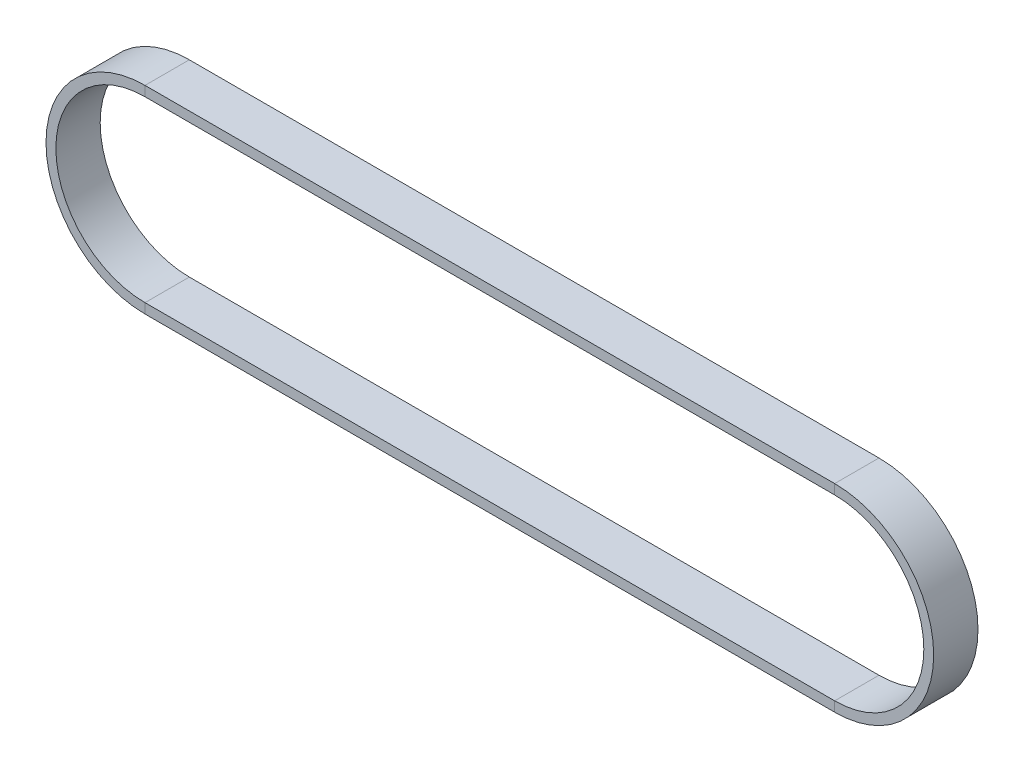
ISO-10303-21;
HEADER;
FILE_DESCRIPTION(('STEP AP214'),'2;1');
FILE_NAME('part.step','',(''),(''),'','','');
FILE_SCHEMA(('AUTOMOTIVE_DESIGN { 1 0 10303 214 1 1 1 1 }'));
ENDSEC;
DATA;
#1=APPLICATION_CONTEXT('core data for automotive mechanical design processes');
#2=APPLICATION_PROTOCOL_DEFINITION('international standard','automotive_design',2000,#1);
#3=PRODUCT_CONTEXT('',#1,'mechanical');
#4=PRODUCT('Part','Part','',(#3));
#5=PRODUCT_RELATED_PRODUCT_CATEGORY('part','',(#4));
#6=PRODUCT_DEFINITION_FORMATION('','',#4);
#7=PRODUCT_DEFINITION_CONTEXT('part definition',#1,'design');
#8=PRODUCT_DEFINITION('design','',#6,#7);
#9=PRODUCT_DEFINITION_SHAPE('','',#8);
#10=(LENGTH_UNIT() NAMED_UNIT(*) SI_UNIT(.MILLI.,.METRE.));
#11=(NAMED_UNIT(*) PLANE_ANGLE_UNIT() SI_UNIT($,.RADIAN.));
#12=(NAMED_UNIT(*) SI_UNIT($,.STERADIAN.) SOLID_ANGLE_UNIT());
#13=UNCERTAINTY_MEASURE_WITH_UNIT(LENGTH_MEASURE(1.E-05),#10,'distance_accuracy_value','');
#14=(GEOMETRIC_REPRESENTATION_CONTEXT(3) GLOBAL_UNCERTAINTY_ASSIGNED_CONTEXT((#13)) GLOBAL_UNIT_ASSIGNED_CONTEXT((#10,
#11,#12)) REPRESENTATION_CONTEXT('',''));
#15=CARTESIAN_POINT('',(0.,0.,0.));
#16=DIRECTION('',(0.,0.,1.));
#17=DIRECTION('',(1.,0.,0.));
#18=AXIS2_PLACEMENT_3D('',#15,#16,#17);
#19=CARTESIAN_POINT('',(140.02512,18.1008,-4.5));
#20=DIRECTION('',(0.,0.,1.));
#21=DIRECTION('',(1.,0.,0.));
#22=AXIS2_PLACEMENT_3D('',#19,#20,#21);
#23=PLANE('',#22);
#24=DIRECTION('',(0.,1.,0.));
#25=VECTOR('',#24,1.);
#26=CARTESIAN_POINT('',(140.02512,18.1008,-4.5));
#27=LINE('',#26,#25);
#28=CARTESIAN_POINT('',(140.02512,18.1008,-4.5));
#29=VERTEX_POINT('',#28);
#30=CARTESIAN_POINT('',(140.02512,20.1008,-4.5));
#31=VERTEX_POINT('',#30);
#32=EDGE_CURVE('E158',#29,#31,#27,.T.);
#33=ORIENTED_EDGE('',*,*,#32,.F.);
#34=DIRECTION('',(-1.,0.,0.));
#35=VECTOR('',#34,1.);
#36=CARTESIAN_POINT('',(140.02512,18.1008,-4.5));
#37=LINE('',#36,#35);
#38=CARTESIAN_POINT('',(0.,18.1008,-4.5));
#39=VERTEX_POINT('',#38);
#40=EDGE_CURVE('E157',#29,#39,#37,.T.);
#41=ORIENTED_EDGE('',*,*,#40,.T.);
#42=DIRECTION('',(0.,1.,0.));
#43=VECTOR('',#42,1.);
#44=CARTESIAN_POINT('',(0.,18.1008,-4.5));
#45=LINE('',#44,#43);
#46=CARTESIAN_POINT('',(0.,20.1008,-4.5));
#47=VERTEX_POINT('',#46);
#48=EDGE_CURVE('E134',#39,#47,#45,.T.);
#49=ORIENTED_EDGE('',*,*,#48,.T.);
#50=DIRECTION('',(-1.,0.,0.));
#51=VECTOR('',#50,1.);
#52=CARTESIAN_POINT('',(140.02512,20.1008,-4.5));
#53=LINE('',#52,#51);
#54=EDGE_CURVE('E163',#31,#47,#53,.T.);
#55=ORIENTED_EDGE('',*,*,#54,.F.);
#56=EDGE_LOOP('',(#33,#41,#49,#55));
#57=FACE_BOUND('',#56,.T.);
#58=ADVANCED_FACE('F39',(#57),#23,.F.);
#59=CARTESIAN_POINT('',(0.,18.1008,-4.5));
#60=DIRECTION('',(0.,0.,1.));
#61=DIRECTION('',(1.,0.,0.));
#62=AXIS2_PLACEMENT_3D('',#59,#60,#61);
#63=PLANE('',#62);
#64=CARTESIAN_POINT('',(0.,0.,-4.5));
#65=DIRECTION('',(0.,0.,1.));
#66=DIRECTION('',(0.,1.,0.));
#67=AXIS2_PLACEMENT_3D('',#64,#65,#66);
#68=CIRCLE('',#67,20.1008);
#69=CARTESIAN_POINT('',(0.,-20.1008,-4.5));
#70=VERTEX_POINT('',#69);
#71=EDGE_CURVE('E124',#47,#70,#68,.T.);
#72=ORIENTED_EDGE('',*,*,#71,.F.);
#73=ORIENTED_EDGE('',*,*,#48,.F.);
#74=CARTESIAN_POINT('',(0.,0.,-4.5));
#75=DIRECTION('',(0.,0.,1.));
#76=DIRECTION('',(0.,1.,0.));
#77=AXIS2_PLACEMENT_3D('',#74,#75,#76);
#78=CIRCLE('',#77,18.1008);
#79=CARTESIAN_POINT('',(0.,-18.1008,-4.5));
#80=VERTEX_POINT('',#79);
#81=EDGE_CURVE('E137',#39,#80,#78,.T.);
#82=ORIENTED_EDGE('',*,*,#81,.T.);
#83=DIRECTION('',(0.,-1.,0.));
#84=VECTOR('',#83,1.);
#85=CARTESIAN_POINT('',(0.,-18.1008,-4.5));
#86=LINE('',#85,#84);
#87=EDGE_CURVE('E154',#80,#70,#86,.T.);
#88=ORIENTED_EDGE('',*,*,#87,.T.);
#89=EDGE_LOOP('',(#72,#73,#82,#88));
#90=FACE_BOUND('',#89,.T.);
#91=ADVANCED_FACE('F136',(#90),#63,.F.);
#92=CARTESIAN_POINT('',(0.,0.,0.));
#93=DIRECTION('',(0.,0.,1.));
#94=DIRECTION('',(1.,0.,0.));
#95=AXIS2_PLACEMENT_3D('',#92,#93,#94);
#96=CYLINDRICAL_SURFACE('',#95,20.1008);
#97=CARTESIAN_POINT('',(0.,0.,4.5));
#98=DIRECTION('',(0.,0.,1.));
#99=DIRECTION('',(0.,1.,0.));
#100=AXIS2_PLACEMENT_3D('',#97,#98,#99);
#101=CIRCLE('',#100,20.1008);
#102=CARTESIAN_POINT('',(0.,20.1008,4.5));
#103=VERTEX_POINT('',#102);
#104=CARTESIAN_POINT('',(0.,-20.1008,4.5));
#105=VERTEX_POINT('',#104);
#106=EDGE_CURVE('E118',#103,#105,#101,.T.);
#107=ORIENTED_EDGE('',*,*,#106,.F.);
#108=DIRECTION('',(0.,0.,1.));
#109=VECTOR('',#108,1.);
#110=CARTESIAN_POINT('',(0.,20.1008,-4.5));
#111=LINE('',#110,#109);
#112=EDGE_CURVE('E143',#47,#103,#111,.T.);
#113=ORIENTED_EDGE('',*,*,#112,.F.);
#114=ORIENTED_EDGE('',*,*,#71,.T.);
#115=DIRECTION('',(0.,0.,1.));
#116=VECTOR('',#115,1.);
#117=CARTESIAN_POINT('',(0.,-20.1008,-4.5));
#118=LINE('',#117,#116);
#119=EDGE_CURVE('E221',#70,#105,#118,.T.);
#120=ORIENTED_EDGE('',*,*,#119,.T.);
#121=EDGE_LOOP('',(#107,#113,#114,#120));
#122=FACE_BOUND('',#121,.T.);
#123=ADVANCED_FACE('F250',(#122),#96,.T.);
#124=CARTESIAN_POINT('',(0.,18.1008,4.5));
#125=DIRECTION('',(0.,0.,-1.));
#126=DIRECTION('',(-1.,0.,0.));
#127=AXIS2_PLACEMENT_3D('',#124,#125,#126);
#128=PLANE('',#127);
#129=CARTESIAN_POINT('',(0.,0.,4.5));
#130=DIRECTION('',(0.,0.,1.));
#131=DIRECTION('',(0.,1.,0.));
#132=AXIS2_PLACEMENT_3D('',#129,#130,#131);
#133=CIRCLE('',#132,18.1008);
#134=CARTESIAN_POINT('',(0.,18.1008,4.5));
#135=VERTEX_POINT('',#134);
#136=CARTESIAN_POINT('',(0.,-18.1008,4.5));
#137=VERTEX_POINT('',#136);
#138=EDGE_CURVE('E176',#135,#137,#133,.T.);
#139=ORIENTED_EDGE('',*,*,#138,.F.);
#140=DIRECTION('',(0.,-1.,0.));
#141=VECTOR('',#140,1.);
#142=CARTESIAN_POINT('',(0.,18.1008,4.5));
#143=LINE('',#142,#141);
#144=EDGE_CURVE('E167',#103,#135,#143,.T.);
#145=ORIENTED_EDGE('',*,*,#144,.F.);
#146=ORIENTED_EDGE('',*,*,#106,.T.);
#147=DIRECTION('',(0.,1.,0.));
#148=VECTOR('',#147,1.);
#149=CARTESIAN_POINT('',(0.,-18.1008,4.5));
#150=LINE('',#149,#148);
#151=EDGE_CURVE('E201',#105,#137,#150,.T.);
#152=ORIENTED_EDGE('',*,*,#151,.T.);
#153=EDGE_LOOP('',(#139,#145,#146,#152));
#154=FACE_BOUND('',#153,.T.);
#155=ADVANCED_FACE('F200',(#154),#128,.F.);
#156=CARTESIAN_POINT('',(0.,0.,0.));
#157=DIRECTION('',(0.,0.,1.));
#158=DIRECTION('',(1.,0.,0.));
#159=AXIS2_PLACEMENT_3D('',#156,#157,#158);
#160=CYLINDRICAL_SURFACE('',#159,18.1008);
#161=DIRECTION('',(0.,0.,-1.));
#162=VECTOR('',#161,1.);
#163=CARTESIAN_POINT('',(0.,-18.1008,-4.5));
#164=LINE('',#163,#162);
#165=EDGE_CURVE('E151',#137,#80,#164,.T.);
#166=ORIENTED_EDGE('',*,*,#165,.T.);
#167=ORIENTED_EDGE('',*,*,#81,.F.);
#168=DIRECTION('',(0.,0.,-1.));
#169=VECTOR('',#168,1.);
#170=CARTESIAN_POINT('',(0.,18.1008,-4.5));
#171=LINE('',#170,#169);
#172=EDGE_CURVE('E150',#135,#39,#171,.T.);
#173=ORIENTED_EDGE('',*,*,#172,.F.);
#174=ORIENTED_EDGE('',*,*,#138,.T.);
#175=EDGE_LOOP('',(#166,#167,#173,#174));
#176=FACE_BOUND('',#175,.T.);
#177=ADVANCED_FACE('F148',(#176),#160,.F.);
#178=CARTESIAN_POINT('',(0.,-18.1008,-4.5));
#179=DIRECTION('',(0.,0.,1.));
#180=DIRECTION('',(1.,0.,0.));
#181=AXIS2_PLACEMENT_3D('',#178,#179,#180);
#182=PLANE('',#181);
#183=DIRECTION('',(1.,0.,0.));
#184=VECTOR('',#183,1.);
#185=CARTESIAN_POINT('',(0.,-20.1008,-4.5));
#186=LINE('',#185,#184);
#187=CARTESIAN_POINT('',(140.02512,-20.1008,-4.5));
#188=VERTEX_POINT('',#187);
#189=EDGE_CURVE('E105',#70,#188,#186,.T.);
#190=ORIENTED_EDGE('',*,*,#189,.F.);
#191=ORIENTED_EDGE('',*,*,#87,.F.);
#192=DIRECTION('',(1.,0.,0.));
#193=VECTOR('',#192,1.);
#194=CARTESIAN_POINT('',(0.,-18.1008,-4.5));
#195=LINE('',#194,#193);
#196=CARTESIAN_POINT('',(140.02512,-18.1008,-4.5));
#197=VERTEX_POINT('',#196);
#198=EDGE_CURVE('E175',#80,#197,#195,.T.);
#199=ORIENTED_EDGE('',*,*,#198,.T.);
#200=DIRECTION('',(0.,-1.,0.));
#201=VECTOR('',#200,1.);
#202=CARTESIAN_POINT('',(140.02512,-18.1008,-4.5));
#203=LINE('',#202,#201);
#204=EDGE_CURVE('E237',#197,#188,#203,.T.);
#205=ORIENTED_EDGE('',*,*,#204,.T.);
#206=EDGE_LOOP('',(#190,#191,#199,#205));
#207=FACE_BOUND('',#206,.T.);
#208=ADVANCED_FACE('F246',(#207),#182,.F.);
#209=CARTESIAN_POINT('',(0.,-20.1008,-4.5));
#210=DIRECTION('',(0.,1.,0.));
#211=DIRECTION('',(0.,0.,1.));
#212=AXIS2_PLACEMENT_3D('',#209,#210,#211);
#213=PLANE('',#212);
#214=DIRECTION('',(1.,0.,0.));
#215=VECTOR('',#214,1.);
#216=CARTESIAN_POINT('',(0.,-20.1008,4.5));
#217=LINE('',#216,#215);
#218=CARTESIAN_POINT('',(140.02512,-20.1008,4.5));
#219=VERTEX_POINT('',#218);
#220=EDGE_CURVE('E98',#105,#219,#217,.T.);
#221=ORIENTED_EDGE('',*,*,#220,.F.);
#222=ORIENTED_EDGE('',*,*,#119,.F.);
#223=ORIENTED_EDGE('',*,*,#189,.T.);
#224=DIRECTION('',(0.,0.,1.));
#225=VECTOR('',#224,1.);
#226=CARTESIAN_POINT('',(140.02512,-20.1008,-4.5));
#227=LINE('',#226,#225);
#228=EDGE_CURVE('E216',#188,#219,#227,.T.);
#229=ORIENTED_EDGE('',*,*,#228,.T.);
#230=EDGE_LOOP('',(#221,#222,#223,#229));
#231=FACE_BOUND('',#230,.T.);
#232=ADVANCED_FACE('F249',(#231),#213,.F.);
#233=CARTESIAN_POINT('',(0.,-18.1008,4.5));
#234=DIRECTION('',(0.,0.,-1.));
#235=DIRECTION('',(0.,1.,0.));
#236=AXIS2_PLACEMENT_3D('',#233,#234,#235);
#237=PLANE('',#236);
#238=DIRECTION('',(1.,0.,0.));
#239=VECTOR('',#238,1.);
#240=CARTESIAN_POINT('',(0.,-18.1008,4.5));
#241=LINE('',#240,#239);
#242=CARTESIAN_POINT('',(140.02512,-18.1008,4.5));
#243=VERTEX_POINT('',#242);
#244=EDGE_CURVE('E89',#137,#243,#241,.T.);
#245=ORIENTED_EDGE('',*,*,#244,.F.);
#246=ORIENTED_EDGE('',*,*,#151,.F.);
#247=ORIENTED_EDGE('',*,*,#220,.T.);
#248=DIRECTION('',(0.,1.,0.));
#249=VECTOR('',#248,1.);
#250=CARTESIAN_POINT('',(140.02512,-18.1008,4.5));
#251=LINE('',#250,#249);
#252=EDGE_CURVE('E184',#219,#243,#251,.T.);
#253=ORIENTED_EDGE('',*,*,#252,.T.);
#254=EDGE_LOOP('',(#245,#246,#247,#253));
#255=FACE_BOUND('',#254,.T.);
#256=ADVANCED_FACE('F268',(#255),#237,.F.);
#257=CARTESIAN_POINT('',(0.,-18.1008,-4.5));
#258=DIRECTION('',(0.,-1.,0.));
#259=DIRECTION('',(1.,0.,0.));
#260=AXIS2_PLACEMENT_3D('',#257,#258,#259);
#261=PLANE('',#260);
#262=DIRECTION('',(0.,0.,-1.));
#263=VECTOR('',#262,1.);
#264=CARTESIAN_POINT('',(140.02512,-18.1008,-4.5));
#265=LINE('',#264,#263);
#266=EDGE_CURVE('E177',#243,#197,#265,.T.);
#267=ORIENTED_EDGE('',*,*,#266,.T.);
#268=ORIENTED_EDGE('',*,*,#198,.F.);
#269=ORIENTED_EDGE('',*,*,#165,.F.);
#270=ORIENTED_EDGE('',*,*,#244,.T.);
#271=EDGE_LOOP('',(#267,#268,#269,#270));
#272=FACE_BOUND('',#271,.T.);
#273=ADVANCED_FACE('F260',(#272),#261,.F.);
#274=CARTESIAN_POINT('',(140.02512,-18.1008,-4.5));
#275=DIRECTION('',(0.,0.,1.));
#276=DIRECTION('',(1.,0.,0.));
#277=AXIS2_PLACEMENT_3D('',#274,#275,#276);
#278=PLANE('',#277);
#279=CARTESIAN_POINT('',(140.02512,0.,-4.5));
#280=DIRECTION('',(0.,0.,1.));
#281=DIRECTION('',(0.,-1.,0.));
#282=AXIS2_PLACEMENT_3D('',#279,#280,#281);
#283=CIRCLE('',#282,20.1008);
#284=EDGE_CURVE('E213',#188,#31,#283,.T.);
#285=ORIENTED_EDGE('',*,*,#284,.F.);
#286=ORIENTED_EDGE('',*,*,#204,.F.);
#287=CARTESIAN_POINT('',(140.02512,0.,-4.5));
#288=DIRECTION('',(0.,0.,1.));
#289=DIRECTION('',(0.,-1.,0.));
#290=AXIS2_PLACEMENT_3D('',#287,#288,#289);
#291=CIRCLE('',#290,18.1008);
#292=EDGE_CURVE('E179',#197,#29,#291,.T.);
#293=ORIENTED_EDGE('',*,*,#292,.T.);
#294=ORIENTED_EDGE('',*,*,#32,.T.);
#295=EDGE_LOOP('',(#285,#286,#293,#294));
#296=FACE_BOUND('',#295,.T.);
#297=ADVANCED_FACE('F258',(#296),#278,.F.);
#298=CARTESIAN_POINT('',(140.02512,0.,0.));
#299=DIRECTION('',(0.,0.,1.));
#300=DIRECTION('',(1.,0.,0.));
#301=AXIS2_PLACEMENT_3D('',#298,#299,#300);
#302=CYLINDRICAL_SURFACE('',#301,20.1008);
#303=CARTESIAN_POINT('',(140.02512,0.,4.5));
#304=DIRECTION('',(0.,0.,1.));
#305=DIRECTION('',(0.,-1.,0.));
#306=AXIS2_PLACEMENT_3D('',#303,#304,#305);
#307=CIRCLE('',#306,20.1008);
#308=CARTESIAN_POINT('',(140.02512,20.1008,4.5));
#309=VERTEX_POINT('',#308);
#310=EDGE_CURVE('E65',#219,#309,#307,.T.);
#311=ORIENTED_EDGE('',*,*,#310,.F.);
#312=ORIENTED_EDGE('',*,*,#228,.F.);
#313=ORIENTED_EDGE('',*,*,#284,.T.);
#314=DIRECTION('',(0.,0.,1.));
#315=VECTOR('',#314,1.);
#316=CARTESIAN_POINT('',(140.02512,20.1008,-4.5));
#317=LINE('',#316,#315);
#318=EDGE_CURVE('E210',#31,#309,#317,.T.);
#319=ORIENTED_EDGE('',*,*,#318,.T.);
#320=EDGE_LOOP('',(#311,#312,#313,#319));
#321=FACE_BOUND('',#320,.T.);
#322=ADVANCED_FACE('F255',(#321),#302,.T.);
#323=CARTESIAN_POINT('',(140.02512,-18.1008,4.5));
#324=DIRECTION('',(0.,0.,-1.));
#325=DIRECTION('',(-1.,0.,0.));
#326=AXIS2_PLACEMENT_3D('',#323,#324,#325);
#327=PLANE('',#326);
#328=CARTESIAN_POINT('',(140.02512,0.,4.5));
#329=DIRECTION('',(0.,0.,1.));
#330=DIRECTION('',(0.,-1.,0.));
#331=AXIS2_PLACEMENT_3D('',#328,#329,#330);
#332=CIRCLE('',#331,18.1008);
#333=CARTESIAN_POINT('',(140.02512,18.1008,4.5));
#334=VERTEX_POINT('',#333);
#335=EDGE_CURVE('E57',#243,#334,#332,.T.);
#336=ORIENTED_EDGE('',*,*,#335,.F.);
#337=ORIENTED_EDGE('',*,*,#252,.F.);
#338=ORIENTED_EDGE('',*,*,#310,.T.);
#339=DIRECTION('',(0.,-1.,0.));
#340=VECTOR('',#339,1.);
#341=CARTESIAN_POINT('',(140.02512,18.1008,4.5));
#342=LINE('',#341,#340);
#343=EDGE_CURVE('E190',#309,#334,#342,.T.);
#344=ORIENTED_EDGE('',*,*,#343,.T.);
#345=EDGE_LOOP('',(#336,#337,#338,#344));
#346=FACE_BOUND('',#345,.T.);
#347=ADVANCED_FACE('F266',(#346),#327,.F.);
#348=CARTESIAN_POINT('',(140.02512,0.,0.));
#349=DIRECTION('',(0.,0.,1.));
#350=DIRECTION('',(1.,0.,0.));
#351=AXIS2_PLACEMENT_3D('',#348,#349,#350);
#352=CYLINDRICAL_SURFACE('',#351,18.1008);
#353=DIRECTION('',(0.,0.,-1.));
#354=VECTOR('',#353,1.);
#355=CARTESIAN_POINT('',(140.02512,18.1008,-4.5));
#356=LINE('',#355,#354);
#357=EDGE_CURVE('E43',#334,#29,#356,.T.);
#358=ORIENTED_EDGE('',*,*,#357,.T.);
#359=ORIENTED_EDGE('',*,*,#292,.F.);
#360=ORIENTED_EDGE('',*,*,#266,.F.);
#361=ORIENTED_EDGE('',*,*,#335,.T.);
#362=EDGE_LOOP('',(#358,#359,#360,#361));
#363=FACE_BOUND('',#362,.T.);
#364=ADVANCED_FACE('F194',(#363),#352,.F.);
#365=CARTESIAN_POINT('',(140.02512,20.1008,-4.5));
#366=DIRECTION('',(0.,-1.,0.));
#367=DIRECTION('',(0.,0.,-1.));
#368=AXIS2_PLACEMENT_3D('',#365,#366,#367);
#369=PLANE('',#368);
#370=ORIENTED_EDGE('',*,*,#54,.T.);
#371=ORIENTED_EDGE('',*,*,#112,.T.);
#372=DIRECTION('',(-1.,0.,0.));
#373=VECTOR('',#372,1.);
#374=CARTESIAN_POINT('',(140.02512,20.1008,4.5));
#375=LINE('',#374,#373);
#376=EDGE_CURVE('E49',#309,#103,#375,.T.);
#377=ORIENTED_EDGE('',*,*,#376,.F.);
#378=ORIENTED_EDGE('',*,*,#318,.F.);
#379=EDGE_LOOP('',(#370,#371,#377,#378));
#380=FACE_BOUND('',#379,.T.);
#381=ADVANCED_FACE('F252',(#380),#369,.F.);
#382=CARTESIAN_POINT('',(140.02512,18.1008,4.5));
#383=DIRECTION('',(0.,0.,-1.));
#384=DIRECTION('',(0.,1.,0.));
#385=AXIS2_PLACEMENT_3D('',#382,#383,#384);
#386=PLANE('',#385);
#387=ORIENTED_EDGE('',*,*,#376,.T.);
#388=ORIENTED_EDGE('',*,*,#144,.T.);
#389=DIRECTION('',(-1.,0.,0.));
#390=VECTOR('',#389,1.);
#391=CARTESIAN_POINT('',(140.02512,18.1008,4.5));
#392=LINE('',#391,#390);
#393=EDGE_CURVE('E11',#334,#135,#392,.T.);
#394=ORIENTED_EDGE('',*,*,#393,.F.);
#395=ORIENTED_EDGE('',*,*,#343,.F.);
#396=EDGE_LOOP('',(#387,#388,#394,#395));
#397=FACE_BOUND('',#396,.T.);
#398=ADVANCED_FACE('F198',(#397),#386,.F.);
#399=CARTESIAN_POINT('',(140.02512,18.1008,-4.5));
#400=DIRECTION('',(0.,1.,0.));
#401=DIRECTION('',(-1.,0.,0.));
#402=AXIS2_PLACEMENT_3D('',#399,#400,#401);
#403=PLANE('',#402);
#404=ORIENTED_EDGE('',*,*,#393,.T.);
#405=ORIENTED_EDGE('',*,*,#172,.T.);
#406=ORIENTED_EDGE('',*,*,#40,.F.);
#407=ORIENTED_EDGE('',*,*,#357,.F.);
#408=EDGE_LOOP('',(#404,#405,#406,#407));
#409=FACE_BOUND('',#408,.T.);
#410=ADVANCED_FACE('F41',(#409),#403,.F.);
#411=CLOSED_SHELL('',(#58,#91,#123,#155,#177,#208,#232,#256,#273,#297,#322,#347,#364,#381,#398,#410));
#412=MANIFOLD_SOLID_BREP('B2',#411);
#413=ADVANCED_BREP_SHAPE_REPRESENTATION('',(#18,#412),#14);
#414=SHAPE_DEFINITION_REPRESENTATION(#9,#413);
ENDSEC;
END-ISO-10303-21;
